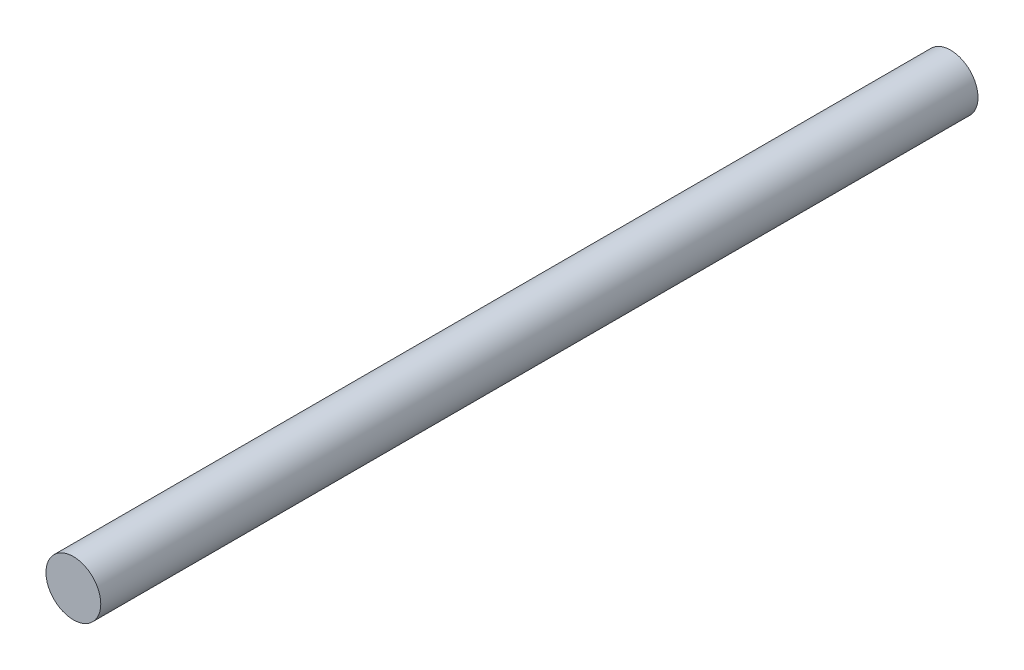
ISO-10303-21;
HEADER;
FILE_DESCRIPTION(('STEP AP214'),'2;1');
FILE_NAME('part.step','',(''),(''),'','','');
FILE_SCHEMA(('AUTOMOTIVE_DESIGN { 1 0 10303 214 1 1 1 1 }'));
ENDSEC;
DATA;
#1=APPLICATION_CONTEXT('core data for automotive mechanical design processes');
#2=APPLICATION_PROTOCOL_DEFINITION('international standard','automotive_design',2000,#1);
#3=PRODUCT_CONTEXT('',#1,'mechanical');
#4=PRODUCT('Part','Part','',(#3));
#5=PRODUCT_RELATED_PRODUCT_CATEGORY('part','',(#4));
#6=PRODUCT_DEFINITION_FORMATION('','',#4);
#7=PRODUCT_DEFINITION_CONTEXT('part definition',#1,'design');
#8=PRODUCT_DEFINITION('design','',#6,#7);
#9=PRODUCT_DEFINITION_SHAPE('','',#8);
#10=(LENGTH_UNIT() NAMED_UNIT(*) SI_UNIT(.MILLI.,.METRE.));
#11=(NAMED_UNIT(*) PLANE_ANGLE_UNIT() SI_UNIT($,.RADIAN.));
#12=(NAMED_UNIT(*) SI_UNIT($,.STERADIAN.) SOLID_ANGLE_UNIT());
#13=UNCERTAINTY_MEASURE_WITH_UNIT(LENGTH_MEASURE(1.E-05),#10,'distance_accuracy_value','');
#14=(GEOMETRIC_REPRESENTATION_CONTEXT(3) GLOBAL_UNCERTAINTY_ASSIGNED_CONTEXT((#13)) GLOBAL_UNIT_ASSIGNED_CONTEXT((#10,
#11,#12)) REPRESENTATION_CONTEXT('',''));
#15=CARTESIAN_POINT('',(0.,0.,0.));
#16=DIRECTION('',(0.,0.,1.));
#17=DIRECTION('',(1.,0.,0.));
#18=AXIS2_PLACEMENT_3D('',#15,#16,#17);
#19=CARTESIAN_POINT('',(0.,0.,20.32));
#20=DIRECTION('',(0.,0.,-1.));
#21=DIRECTION('',(-1.,0.,0.));
#22=AXIS2_PLACEMENT_3D('',#19,#20,#21);
#23=CYLINDRICAL_SURFACE('',#22,0.635);
#24=CARTESIAN_POINT('',(0.,0.,20.32));
#25=DIRECTION('',(0.,0.,1.));
#26=DIRECTION('',(1.,0.,0.));
#27=AXIS2_PLACEMENT_3D('',#24,#25,#26);
#28=CIRCLE('',#27,0.635);
#29=CARTESIAN_POINT('',(0.635000000000001,0.,20.32));
#30=VERTEX_POINT('',#29);
#31=EDGE_CURVE('E10',#30,#30,#28,.T.);
#32=ORIENTED_EDGE('',*,*,#31,.F.);
#33=EDGE_LOOP('',(#32));
#34=FACE_BOUND('',#33,.T.);
#35=CARTESIAN_POINT('',(0.,0.,0.));
#36=DIRECTION('',(0.,0.,1.));
#37=DIRECTION('',(1.,0.,0.));
#38=AXIS2_PLACEMENT_3D('',#35,#36,#37);
#39=CIRCLE('',#38,0.635);
#40=CARTESIAN_POINT('',(0.635000000000001,0.,0.));
#41=VERTEX_POINT('',#40);
#42=EDGE_CURVE('E39',#41,#41,#39,.T.);
#43=ORIENTED_EDGE('',*,*,#42,.T.);
#44=EDGE_LOOP('',(#43));
#45=FACE_BOUND('',#44,.T.);
#46=ADVANCED_FACE('F36',(#34,#45),#23,.T.);
#47=CARTESIAN_POINT('',(0.,0.,20.32));
#48=DIRECTION('',(0.,0.,1.));
#49=DIRECTION('',(1.,0.,0.));
#50=AXIS2_PLACEMENT_3D('',#47,#48,#49);
#51=PLANE('',#50);
#52=ORIENTED_EDGE('',*,*,#31,.T.);
#53=EDGE_LOOP('',(#52));
#54=FACE_BOUND('',#53,.T.);
#55=ADVANCED_FACE('F55',(#54),#51,.T.);
#56=CARTESIAN_POINT('',(0.,0.,0.));
#57=DIRECTION('',(0.,0.,1.));
#58=DIRECTION('',(1.,0.,0.));
#59=AXIS2_PLACEMENT_3D('',#56,#57,#58);
#60=PLANE('',#59);
#61=ORIENTED_EDGE('',*,*,#42,.F.);
#62=EDGE_LOOP('',(#61));
#63=FACE_BOUND('',#62,.T.);
#64=ADVANCED_FACE('F53',(#63),#60,.F.);
#65=CLOSED_SHELL('',(#46,#55,#64));
#66=MANIFOLD_SOLID_BREP('B2',#65);
#67=ADVANCED_BREP_SHAPE_REPRESENTATION('',(#18,#66),#14);
#68=SHAPE_DEFINITION_REPRESENTATION(#9,#67);
ENDSEC;
END-ISO-10303-21;
